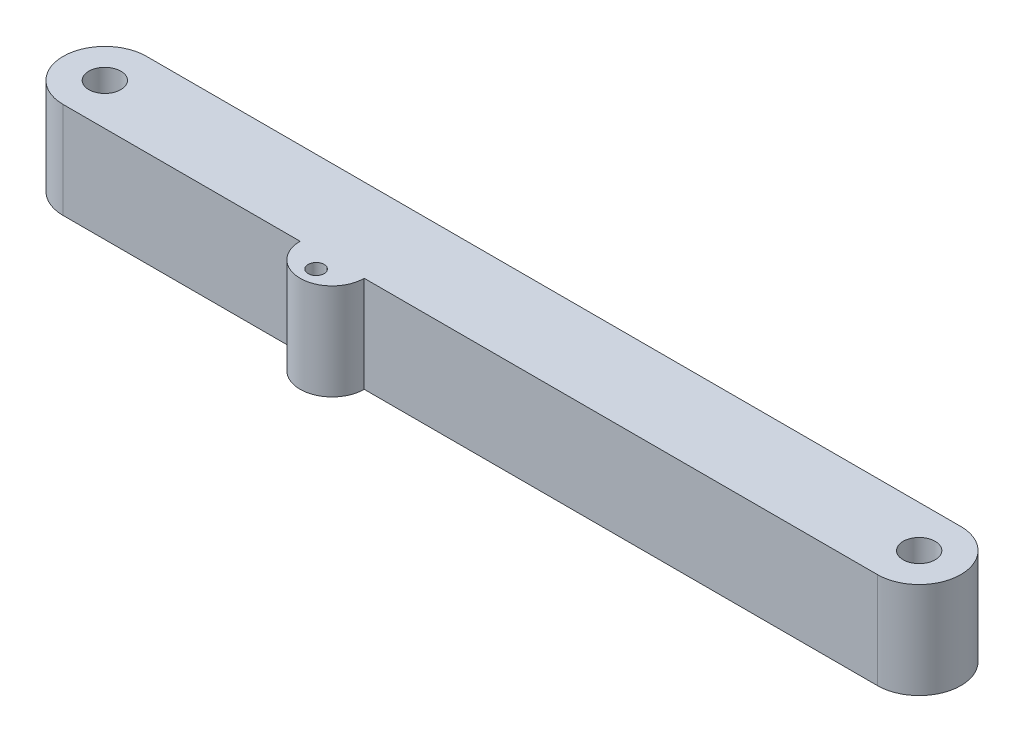
ISO-10303-21;
HEADER;
FILE_DESCRIPTION(('STEP AP214'),'2;1');
FILE_NAME('part.step','',(''),(''),'','','');
FILE_SCHEMA(('AUTOMOTIVE_DESIGN { 1 0 10303 214 1 1 1 1 }'));
ENDSEC;
DATA;
#1=APPLICATION_CONTEXT('core data for automotive mechanical design processes');
#2=APPLICATION_PROTOCOL_DEFINITION('international standard','automotive_design',2000,#1);
#3=PRODUCT_CONTEXT('',#1,'mechanical');
#4=PRODUCT('Part','Part','',(#3));
#5=PRODUCT_RELATED_PRODUCT_CATEGORY('part','',(#4));
#6=PRODUCT_DEFINITION_FORMATION('','',#4);
#7=PRODUCT_DEFINITION_CONTEXT('part definition',#1,'design');
#8=PRODUCT_DEFINITION('design','',#6,#7);
#9=PRODUCT_DEFINITION_SHAPE('','',#8);
#10=(LENGTH_UNIT() NAMED_UNIT(*) SI_UNIT(.MILLI.,.METRE.));
#11=(NAMED_UNIT(*) PLANE_ANGLE_UNIT() SI_UNIT($,.RADIAN.));
#12=(NAMED_UNIT(*) SI_UNIT($,.STERADIAN.) SOLID_ANGLE_UNIT());
#13=UNCERTAINTY_MEASURE_WITH_UNIT(LENGTH_MEASURE(1.E-05),#10,'distance_accuracy_value','');
#14=(GEOMETRIC_REPRESENTATION_CONTEXT(3) GLOBAL_UNCERTAINTY_ASSIGNED_CONTEXT((#13)) GLOBAL_UNIT_ASSIGNED_CONTEXT((#10,
#11,#12)) REPRESENTATION_CONTEXT('',''));
#15=CARTESIAN_POINT('',(0.,0.,0.));
#16=DIRECTION('',(0.,0.,1.));
#17=DIRECTION('',(1.,0.,0.));
#18=AXIS2_PLACEMENT_3D('',#15,#16,#17);
#19=CARTESIAN_POINT('',(-80.645,19.05,8.255));
#20=DIRECTION('',(0.,0.,-1.));
#21=DIRECTION('',(-1.,0.,0.));
#22=AXIS2_PLACEMENT_3D('',#19,#20,#21);
#23=PLANE('',#22);
#24=DIRECTION('',(1.,0.,0.));
#25=VECTOR('',#24,1.);
#26=CARTESIAN_POINT('',(-80.645,0.,8.255));
#27=LINE('',#26,#25);
#28=CARTESIAN_POINT('',(-80.645,0.,8.255));
#29=VERTEX_POINT('',#28);
#30=CARTESIAN_POINT('',(-33.713899298,0.,8.255));
#31=VERTEX_POINT('',#30);
#32=EDGE_CURVE('E98',#29,#31,#27,.T.);
#33=ORIENTED_EDGE('',*,*,#32,.T.);
#34=DIRECTION('',(0.,1.,0.));
#35=VECTOR('',#34,1.);
#36=CARTESIAN_POINT('',(-33.713899298,-14.1990316571237,8.255));
#37=LINE('',#36,#35);
#38=CARTESIAN_POINT('',(-33.713899298,19.05,8.255));
#39=VERTEX_POINT('',#38);
#40=EDGE_CURVE('E58',#31,#39,#37,.T.);
#41=ORIENTED_EDGE('',*,*,#40,.T.);
#42=DIRECTION('',(1.,0.,0.));
#43=VECTOR('',#42,1.);
#44=CARTESIAN_POINT('',(-80.645,19.05,8.255));
#45=LINE('',#44,#43);
#46=CARTESIAN_POINT('',(-80.645,19.05,8.255));
#47=VERTEX_POINT('',#46);
#48=EDGE_CURVE('E135',#47,#39,#45,.T.);
#49=ORIENTED_EDGE('',*,*,#48,.F.);
#50=DIRECTION('',(0.,-1.,0.));
#51=VECTOR('',#50,1.);
#52=CARTESIAN_POINT('',(-80.645,19.05,8.255));
#53=LINE('',#52,#51);
#54=EDGE_CURVE('E11',#47,#29,#53,.T.);
#55=ORIENTED_EDGE('',*,*,#54,.T.);
#56=EDGE_LOOP('',(#33,#41,#49,#55));
#57=FACE_BOUND('',#56,.T.);
#58=ADVANCED_FACE('F35',(#57),#23,.F.);
#59=CARTESIAN_POINT('',(-80.645,19.05,0.));
#60=DIRECTION('',(0.,1.,0.));
#61=DIRECTION('',(0.,0.,1.));
#62=AXIS2_PLACEMENT_3D('',#59,#60,#61);
#63=PLANE('',#62);
#64=CARTESIAN_POINT('',(-80.645,19.05,0.));
#65=DIRECTION('',(0.,1.,0.));
#66=DIRECTION('',(0.,0.,1.));
#67=AXIS2_PLACEMENT_3D('',#64,#65,#66);
#68=CIRCLE('',#67,3.175);
#69=CARTESIAN_POINT('',(-80.645,19.05,3.175));
#70=VERTEX_POINT('',#69);
#71=EDGE_CURVE('E126',#70,#70,#68,.T.);
#72=ORIENTED_EDGE('',*,*,#71,.F.);
#73=EDGE_LOOP('',(#72));
#74=FACE_BOUND('',#73,.T.);
#75=CARTESIAN_POINT('',(-80.645,19.05,0.));
#76=DIRECTION('',(0.,1.,0.));
#77=DIRECTION('',(0.,0.,1.));
#78=AXIS2_PLACEMENT_3D('',#75,#76,#77);
#79=CIRCLE('',#78,8.255);
#80=CARTESIAN_POINT('',(-80.645,19.05,-8.255));
#81=VERTEX_POINT('',#80);
#82=EDGE_CURVE('E131',#81,#47,#79,.T.);
#83=ORIENTED_EDGE('',*,*,#82,.T.);
#84=ORIENTED_EDGE('',*,*,#48,.T.);
#85=CARTESIAN_POINT('',(-27.363899298,19.05,8.255));
#86=DIRECTION('',(0.,1.,0.));
#87=DIRECTION('',(0.,0.,1.));
#88=AXIS2_PLACEMENT_3D('',#85,#86,#87);
#89=CIRCLE('',#88,6.35);
#90=CARTESIAN_POINT('',(-21.013899298,19.05,8.255));
#91=VERTEX_POINT('',#90);
#92=EDGE_CURVE('E106',#39,#91,#89,.T.);
#93=ORIENTED_EDGE('',*,*,#92,.T.);
#94=CARTESIAN_POINT('',(80.645,19.05,8.255));
#95=VERTEX_POINT('',#94);
#96=EDGE_CURVE('E50',#91,#95,#45,.T.);
#97=ORIENTED_EDGE('',*,*,#96,.T.);
#98=CARTESIAN_POINT('',(80.645,19.05,0.));
#99=DIRECTION('',(0.,1.,0.));
#100=DIRECTION('',(0.,0.,-1.));
#101=AXIS2_PLACEMENT_3D('',#98,#99,#100);
#102=CIRCLE('',#101,8.255);
#103=CARTESIAN_POINT('',(80.645,19.05,-8.255));
#104=VERTEX_POINT('',#103);
#105=EDGE_CURVE('E137',#95,#104,#102,.T.);
#106=ORIENTED_EDGE('',*,*,#105,.T.);
#107=DIRECTION('',(-1.,0.,0.));
#108=VECTOR('',#107,1.);
#109=CARTESIAN_POINT('',(-80.645,19.05,-8.255));
#110=LINE('',#109,#108);
#111=EDGE_CURVE('E139',#104,#81,#110,.T.);
#112=ORIENTED_EDGE('',*,*,#111,.T.);
#113=EDGE_LOOP('',(#83,#84,#93,#97,#106,#112));
#114=FACE_BOUND('',#113,.T.);
#115=CARTESIAN_POINT('',(80.645,19.05,0.));
#116=DIRECTION('',(0.,1.,0.));
#117=DIRECTION('',(0.,0.,1.));
#118=AXIS2_PLACEMENT_3D('',#115,#116,#117);
#119=CIRCLE('',#118,3.175);
#120=CARTESIAN_POINT('',(80.645,19.05,3.175));
#121=VERTEX_POINT('',#120);
#122=EDGE_CURVE('E120',#121,#121,#119,.T.);
#123=ORIENTED_EDGE('',*,*,#122,.F.);
#124=EDGE_LOOP('',(#123));
#125=FACE_BOUND('',#124,.T.);
#126=CARTESIAN_POINT('',(-27.363899298,19.05,11.43));
#127=DIRECTION('',(0.,1.,0.));
#128=DIRECTION('',(0.,0.,1.));
#129=AXIS2_PLACEMENT_3D('',#126,#127,#128);
#130=CIRCLE('',#129,1.5875);
#131=CARTESIAN_POINT('',(-27.363899298,19.05,13.0175));
#132=VERTEX_POINT('',#131);
#133=EDGE_CURVE('E116',#132,#132,#130,.T.);
#134=ORIENTED_EDGE('',*,*,#133,.F.);
#135=EDGE_LOOP('',(#134));
#136=FACE_BOUND('',#135,.T.);
#137=ADVANCED_FACE('F156',(#74,#114,#125,#136),#63,.T.);
#138=CARTESIAN_POINT('',(-80.645,0.,0.));
#139=DIRECTION('',(0.,1.,0.));
#140=DIRECTION('',(0.,0.,1.));
#141=AXIS2_PLACEMENT_3D('',#138,#139,#140);
#142=PLANE('',#141);
#143=CARTESIAN_POINT('',(-80.645,0.,0.));
#144=DIRECTION('',(0.,1.,0.));
#145=DIRECTION('',(0.,0.,1.));
#146=AXIS2_PLACEMENT_3D('',#143,#144,#145);
#147=CIRCLE('',#146,8.255);
#148=CARTESIAN_POINT('',(-80.645,0.,-8.255));
#149=VERTEX_POINT('',#148);
#150=EDGE_CURVE('E99',#149,#29,#147,.T.);
#151=ORIENTED_EDGE('',*,*,#150,.F.);
#152=DIRECTION('',(-1.,0.,0.));
#153=VECTOR('',#152,1.);
#154=CARTESIAN_POINT('',(-80.645,0.,-8.255));
#155=LINE('',#154,#153);
#156=CARTESIAN_POINT('',(80.645,0.,-8.255));
#157=VERTEX_POINT('',#156);
#158=EDGE_CURVE('E134',#157,#149,#155,.T.);
#159=ORIENTED_EDGE('',*,*,#158,.F.);
#160=CARTESIAN_POINT('',(80.645,0.,0.));
#161=DIRECTION('',(0.,1.,0.));
#162=DIRECTION('',(0.,0.,-1.));
#163=AXIS2_PLACEMENT_3D('',#160,#161,#162);
#164=CIRCLE('',#163,8.255);
#165=CARTESIAN_POINT('',(80.645,0.,8.255));
#166=VERTEX_POINT('',#165);
#167=EDGE_CURVE('E96',#166,#157,#164,.T.);
#168=ORIENTED_EDGE('',*,*,#167,.F.);
#169=CARTESIAN_POINT('',(-21.013899298,0.,8.255));
#170=VERTEX_POINT('',#169);
#171=EDGE_CURVE('E89',#170,#166,#27,.T.);
#172=ORIENTED_EDGE('',*,*,#171,.F.);
#173=CARTESIAN_POINT('',(-27.363899298,0.,8.255));
#174=DIRECTION('',(0.,1.,0.));
#175=DIRECTION('',(0.,0.,1.));
#176=AXIS2_PLACEMENT_3D('',#173,#174,#175);
#177=CIRCLE('',#176,6.35);
#178=EDGE_CURVE('E94',#170,#31,#177,.F.);
#179=ORIENTED_EDGE('',*,*,#178,.T.);
#180=ORIENTED_EDGE('',*,*,#32,.F.);
#181=EDGE_LOOP('',(#151,#159,#168,#172,#179,#180));
#182=FACE_BOUND('',#181,.T.);
#183=CARTESIAN_POINT('',(-80.645,0.,0.));
#184=DIRECTION('',(0.,1.,0.));
#185=DIRECTION('',(0.,0.,1.));
#186=AXIS2_PLACEMENT_3D('',#183,#184,#185);
#187=CIRCLE('',#186,3.175);
#188=CARTESIAN_POINT('',(-80.645,0.,3.175));
#189=VERTEX_POINT('',#188);
#190=EDGE_CURVE('E123',#189,#189,#187,.T.);
#191=ORIENTED_EDGE('',*,*,#190,.T.);
#192=EDGE_LOOP('',(#191));
#193=FACE_BOUND('',#192,.T.);
#194=CARTESIAN_POINT('',(80.645,0.,0.));
#195=DIRECTION('',(0.,1.,0.));
#196=DIRECTION('',(0.,0.,1.));
#197=AXIS2_PLACEMENT_3D('',#194,#195,#196);
#198=CIRCLE('',#197,3.175);
#199=CARTESIAN_POINT('',(80.645,0.,3.175));
#200=VERTEX_POINT('',#199);
#201=EDGE_CURVE('E112',#200,#200,#198,.T.);
#202=ORIENTED_EDGE('',*,*,#201,.T.);
#203=EDGE_LOOP('',(#202));
#204=FACE_BOUND('',#203,.T.);
#205=CARTESIAN_POINT('',(-27.363899298,0.,11.43));
#206=DIRECTION('',(0.,1.,0.));
#207=DIRECTION('',(0.,0.,1.));
#208=AXIS2_PLACEMENT_3D('',#205,#206,#207);
#209=CIRCLE('',#208,1.5875);
#210=CARTESIAN_POINT('',(-27.363899298,0.,13.0175));
#211=VERTEX_POINT('',#210);
#212=EDGE_CURVE('E109',#211,#211,#209,.F.);
#213=ORIENTED_EDGE('',*,*,#212,.F.);
#214=EDGE_LOOP('',(#213));
#215=FACE_BOUND('',#214,.T.);
#216=ADVANCED_FACE('F91',(#182,#193,#204,#215),#142,.F.);
#217=CARTESIAN_POINT('',(-80.645,19.05,0.));
#218=DIRECTION('',(0.,-1.,0.));
#219=DIRECTION('',(0.,0.,-1.));
#220=AXIS2_PLACEMENT_3D('',#217,#218,#219);
#221=CYLINDRICAL_SURFACE('',#220,8.255);
#222=ORIENTED_EDGE('',*,*,#150,.T.);
#223=ORIENTED_EDGE('',*,*,#54,.F.);
#224=ORIENTED_EDGE('',*,*,#82,.F.);
#225=DIRECTION('',(0.,-1.,0.));
#226=VECTOR('',#225,1.);
#227=CARTESIAN_POINT('',(-80.645,19.05,-8.255));
#228=LINE('',#227,#226);
#229=EDGE_CURVE('E141',#81,#149,#228,.T.);
#230=ORIENTED_EDGE('',*,*,#229,.T.);
#231=EDGE_LOOP('',(#222,#223,#224,#230));
#232=FACE_BOUND('',#231,.T.);
#233=ADVANCED_FACE('F37',(#232),#221,.T.);
#234=ORIENTED_EDGE('',*,*,#96,.F.);
#235=DIRECTION('',(0.,1.,0.));
#236=VECTOR('',#235,1.);
#237=CARTESIAN_POINT('',(-21.013899298,-14.1990316571237,8.255));
#238=LINE('',#237,#236);
#239=EDGE_CURVE('E101',#170,#91,#238,.T.);
#240=ORIENTED_EDGE('',*,*,#239,.F.);
#241=ORIENTED_EDGE('',*,*,#171,.T.);
#242=DIRECTION('',(0.,-1.,0.));
#243=VECTOR('',#242,1.);
#244=CARTESIAN_POINT('',(80.645,19.05,8.255));
#245=LINE('',#244,#243);
#246=EDGE_CURVE('E43',#95,#166,#245,.T.);
#247=ORIENTED_EDGE('',*,*,#246,.F.);
#248=EDGE_LOOP('',(#234,#240,#241,#247));
#249=FACE_BOUND('',#248,.T.);
#250=ADVANCED_FACE('F102',(#249),#23,.F.);
#251=CARTESIAN_POINT('',(80.645,19.05,0.));
#252=DIRECTION('',(0.,-1.,0.));
#253=DIRECTION('',(0.,0.,-1.));
#254=AXIS2_PLACEMENT_3D('',#251,#252,#253);
#255=CYLINDRICAL_SURFACE('',#254,8.255);
#256=ORIENTED_EDGE('',*,*,#167,.T.);
#257=DIRECTION('',(0.,-1.,0.));
#258=VECTOR('',#257,1.);
#259=CARTESIAN_POINT('',(80.645,19.05,-8.255));
#260=LINE('',#259,#258);
#261=EDGE_CURVE('E148',#104,#157,#260,.T.);
#262=ORIENTED_EDGE('',*,*,#261,.F.);
#263=ORIENTED_EDGE('',*,*,#105,.F.);
#264=ORIENTED_EDGE('',*,*,#246,.T.);
#265=EDGE_LOOP('',(#256,#262,#263,#264));
#266=FACE_BOUND('',#265,.T.);
#267=ADVANCED_FACE('F152',(#266),#255,.T.);
#268=CARTESIAN_POINT('',(-80.645,19.05,-8.255));
#269=DIRECTION('',(0.,0.,1.));
#270=DIRECTION('',(1.,0.,0.));
#271=AXIS2_PLACEMENT_3D('',#268,#269,#270);
#272=PLANE('',#271);
#273=ORIENTED_EDGE('',*,*,#158,.T.);
#274=ORIENTED_EDGE('',*,*,#229,.F.);
#275=ORIENTED_EDGE('',*,*,#111,.F.);
#276=ORIENTED_EDGE('',*,*,#261,.T.);
#277=EDGE_LOOP('',(#273,#274,#275,#276));
#278=FACE_BOUND('',#277,.T.);
#279=ADVANCED_FACE('F163',(#278),#272,.F.);
#280=CARTESIAN_POINT('',(-80.645,19.05,0.));
#281=DIRECTION('',(0.,-1.,0.));
#282=DIRECTION('',(0.,0.,-1.));
#283=AXIS2_PLACEMENT_3D('',#280,#281,#282);
#284=CYLINDRICAL_SURFACE('',#283,3.175);
#285=ORIENTED_EDGE('',*,*,#71,.T.);
#286=EDGE_LOOP('',(#285));
#287=FACE_BOUND('',#286,.T.);
#288=ORIENTED_EDGE('',*,*,#190,.F.);
#289=EDGE_LOOP('',(#288));
#290=FACE_BOUND('',#289,.T.);
#291=ADVANCED_FACE('F165',(#287,#290),#284,.F.);
#292=CARTESIAN_POINT('',(80.645,19.05,0.));
#293=DIRECTION('',(0.,-1.,0.));
#294=DIRECTION('',(0.,0.,-1.));
#295=AXIS2_PLACEMENT_3D('',#292,#293,#294);
#296=CYLINDRICAL_SURFACE('',#295,3.175);
#297=ORIENTED_EDGE('',*,*,#122,.T.);
#298=EDGE_LOOP('',(#297));
#299=FACE_BOUND('',#298,.T.);
#300=ORIENTED_EDGE('',*,*,#201,.F.);
#301=EDGE_LOOP('',(#300));
#302=FACE_BOUND('',#301,.T.);
#303=ADVANCED_FACE('F171',(#299,#302),#296,.F.);
#304=CARTESIAN_POINT('',(-27.363899298,-14.1990316571237,11.43));
#305=DIRECTION('',(0.,1.,0.));
#306=DIRECTION('',(0.,0.,1.));
#307=AXIS2_PLACEMENT_3D('',#304,#305,#306);
#308=CYLINDRICAL_SURFACE('',#307,1.5875);
#309=ORIENTED_EDGE('',*,*,#212,.T.);
#310=EDGE_LOOP('',(#309));
#311=FACE_BOUND('',#310,.T.);
#312=ORIENTED_EDGE('',*,*,#133,.T.);
#313=EDGE_LOOP('',(#312));
#314=FACE_BOUND('',#313,.T.);
#315=ADVANCED_FACE('F198',(#311,#314),#308,.F.);
#316=CARTESIAN_POINT('',(-27.363899298,-14.1990316571237,8.255));
#317=DIRECTION('',(0.,1.,0.));
#318=DIRECTION('',(0.,0.,1.));
#319=AXIS2_PLACEMENT_3D('',#316,#317,#318);
#320=CYLINDRICAL_SURFACE('',#319,6.35);
#321=ORIENTED_EDGE('',*,*,#178,.F.);
#322=ORIENTED_EDGE('',*,*,#239,.T.);
#323=ORIENTED_EDGE('',*,*,#92,.F.);
#324=ORIENTED_EDGE('',*,*,#40,.F.);
#325=EDGE_LOOP('',(#321,#322,#323,#324));
#326=FACE_BOUND('',#325,.T.);
#327=ADVANCED_FACE('F108',(#326),#320,.T.);
#328=CLOSED_SHELL('',(#58,#137,#216,#233,#250,#267,#279,#291,#303,#315,#327));
#329=MANIFOLD_SOLID_BREP('B2',#328);
#330=ADVANCED_BREP_SHAPE_REPRESENTATION('',(#18,#329),#14);
#331=SHAPE_DEFINITION_REPRESENTATION(#9,#330);
ENDSEC;
END-ISO-10303-21;
